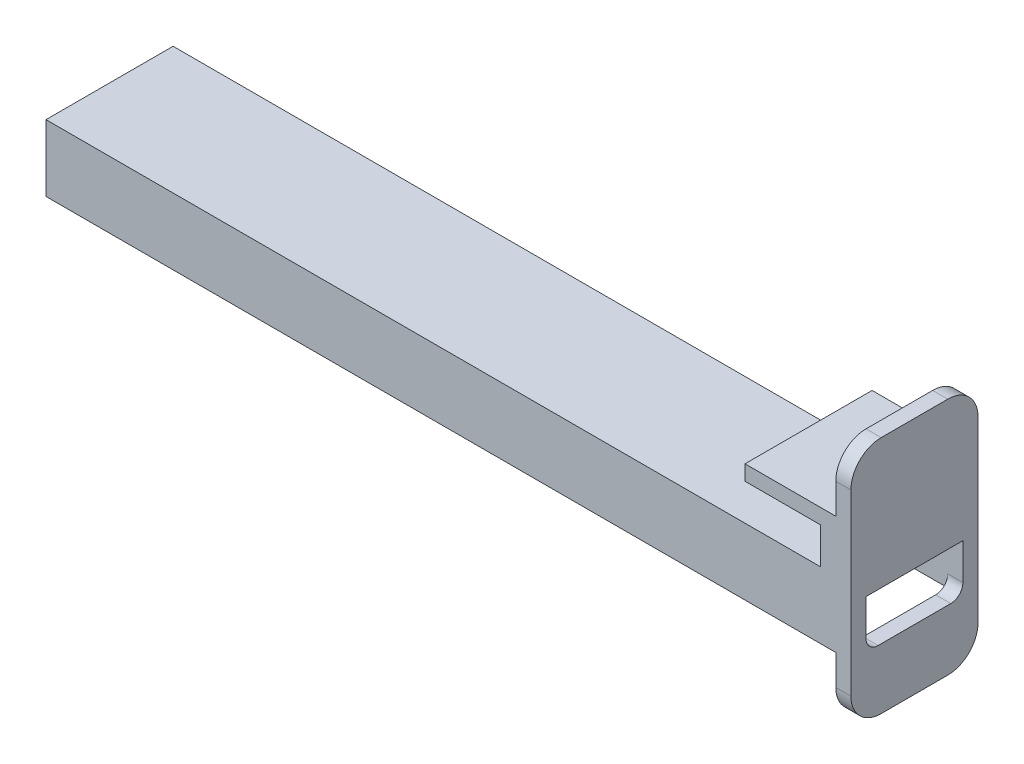
ISO-10303-21;
HEADER;
FILE_DESCRIPTION(('STEP AP214'),'2;1');
FILE_NAME('part.step','',(''),(''),'','','');
FILE_SCHEMA(('AUTOMOTIVE_DESIGN { 1 0 10303 214 1 1 1 1 }'));
ENDSEC;
DATA;
#1=APPLICATION_CONTEXT('core data for automotive mechanical design processes');
#2=APPLICATION_PROTOCOL_DEFINITION('international standard','automotive_design',2000,#1);
#3=PRODUCT_CONTEXT('',#1,'mechanical');
#4=PRODUCT('Part','Part','',(#3));
#5=PRODUCT_RELATED_PRODUCT_CATEGORY('part','',(#4));
#6=PRODUCT_DEFINITION_FORMATION('','',#4);
#7=PRODUCT_DEFINITION_CONTEXT('part definition',#1,'design');
#8=PRODUCT_DEFINITION('design','',#6,#7);
#9=PRODUCT_DEFINITION_SHAPE('','',#8);
#10=(LENGTH_UNIT() NAMED_UNIT(*) SI_UNIT(.MILLI.,.METRE.));
#11=(NAMED_UNIT(*) PLANE_ANGLE_UNIT() SI_UNIT($,.RADIAN.));
#12=(NAMED_UNIT(*) SI_UNIT($,.STERADIAN.) SOLID_ANGLE_UNIT());
#13=UNCERTAINTY_MEASURE_WITH_UNIT(LENGTH_MEASURE(1.E-05),#10,'distance_accuracy_value','');
#14=(GEOMETRIC_REPRESENTATION_CONTEXT(3) GLOBAL_UNCERTAINTY_ASSIGNED_CONTEXT((#13)) GLOBAL_UNIT_ASSIGNED_CONTEXT((#10,
#11,#12)) REPRESENTATION_CONTEXT('',''));
#15=CARTESIAN_POINT('',(0.,0.,0.));
#16=DIRECTION('',(0.,0.,1.));
#17=DIRECTION('',(1.,0.,0.));
#18=AXIS2_PLACEMENT_3D('',#15,#16,#17);
#19=CARTESIAN_POINT('',(0.,0.,0.));
#20=DIRECTION('',(0.,1.,0.));
#21=DIRECTION('',(0.,0.,1.));
#22=AXIS2_PLACEMENT_3D('',#19,#20,#21);
#23=PLANE('',#22);
#24=DIRECTION('',(0.,0.,-1.));
#25=VECTOR('',#24,1.);
#26=CARTESIAN_POINT('',(76.8846153846154,0.,5.53846153846154));
#27=LINE('',#26,#25);
#28=CARTESIAN_POINT('',(76.8846153846154,0.,-12.9615384615384));
#29=VERTEX_POINT('',#28);
#30=CARTESIAN_POINT('',(76.8846153846154,0.,-15.4615384615385));
#31=VERTEX_POINT('',#30);
#32=EDGE_CURVE('E217',#29,#31,#27,.T.);
#33=ORIENTED_EDGE('',*,*,#32,.F.);
#34=DIRECTION('',(1.,0.,0.));
#35=VECTOR('',#34,1.);
#36=CARTESIAN_POINT('',(0.,0.,-12.9615384615385));
#37=LINE('',#36,#35);
#38=CARTESIAN_POINT('',(-53.6153846153846,0.,-12.9615384615385));
#39=VERTEX_POINT('',#38);
#40=EDGE_CURVE('E261',#39,#29,#37,.T.);
#41=ORIENTED_EDGE('',*,*,#40,.F.);
#42=DIRECTION('',(0.,0.,1.));
#43=VECTOR('',#42,1.);
#44=CARTESIAN_POINT('',(-53.6153846153846,0.,0.));
#45=LINE('',#44,#43);
#46=CARTESIAN_POINT('',(-53.6153846153846,0.,-15.4615384615385));
#47=VERTEX_POINT('',#46);
#48=EDGE_CURVE('E253',#47,#39,#45,.T.);
#49=ORIENTED_EDGE('',*,*,#48,.F.);
#50=DIRECTION('',(1.,0.,0.));
#51=VECTOR('',#50,1.);
#52=CARTESIAN_POINT('',(0.,0.,-15.4615384615385));
#53=LINE('',#52,#51);
#54=EDGE_CURVE('E258',#47,#31,#53,.T.);
#55=ORIENTED_EDGE('',*,*,#54,.T.);
#56=EDGE_LOOP('',(#33,#41,#49,#55));
#57=FACE_BOUND('',#56,.T.);
#58=ADVANCED_FACE('F35',(#57),#23,.F.);
#59=CARTESIAN_POINT('',(-53.6153846153846,8.,0.));
#60=DIRECTION('',(1.,0.,0.));
#61=DIRECTION('',(0.,0.,-1.));
#62=AXIS2_PLACEMENT_3D('',#59,#60,#61);
#63=PLANE('',#62);
#64=ORIENTED_EDGE('',*,*,#48,.T.);
#65=DIRECTION('',(0.,-1.,0.));
#66=VECTOR('',#65,1.);
#67=CARTESIAN_POINT('',(-53.6153846153846,8.,-12.9615384615385));
#68=LINE('',#67,#66);
#69=CARTESIAN_POINT('',(-53.6153846153846,8.,-12.9615384615385));
#70=VERTEX_POINT('',#69);
#71=EDGE_CURVE('E266',#70,#39,#68,.T.);
#72=ORIENTED_EDGE('',*,*,#71,.F.);
#73=DIRECTION('',(0.,0.,1.));
#74=VECTOR('',#73,1.);
#75=CARTESIAN_POINT('',(-53.6153846153846,8.,-15.4615384615385));
#76=LINE('',#75,#74);
#77=CARTESIAN_POINT('',(-53.6153846153846,8.,3.03846153846154));
#78=VERTEX_POINT('',#77);
#79=EDGE_CURVE('E238',#70,#78,#76,.T.);
#80=ORIENTED_EDGE('',*,*,#79,.T.);
#81=DIRECTION('',(0.,-1.,0.));
#82=VECTOR('',#81,1.);
#83=CARTESIAN_POINT('',(-53.6153846153846,8.,3.03846153846154));
#84=LINE('',#83,#82);
#85=CARTESIAN_POINT('',(-53.6153846153846,0.,3.03846153846154));
#86=VERTEX_POINT('',#85);
#87=EDGE_CURVE('E232',#78,#86,#84,.T.);
#88=ORIENTED_EDGE('',*,*,#87,.T.);
#89=DIRECTION('',(0.,0.,1.));
#90=VECTOR('',#89,1.);
#91=CARTESIAN_POINT('',(-53.6153846153846,0.,0.));
#92=LINE('',#91,#90);
#93=CARTESIAN_POINT('',(-53.6153846153846,0.,5.53846153846154));
#94=VERTEX_POINT('',#93);
#95=EDGE_CURVE('E210',#86,#94,#92,.T.);
#96=ORIENTED_EDGE('',*,*,#95,.T.);
#97=DIRECTION('',(0.,-1.,0.));
#98=VECTOR('',#97,1.);
#99=CARTESIAN_POINT('',(-53.6153846153846,11.,5.53846153846154));
#100=LINE('',#99,#98);
#101=CARTESIAN_POINT('',(-53.6153846153846,11.,5.53846153846154));
#102=VERTEX_POINT('',#101);
#103=EDGE_CURVE('E249',#102,#94,#100,.T.);
#104=ORIENTED_EDGE('',*,*,#103,.F.);
#105=DIRECTION('',(0.,0.,1.));
#106=VECTOR('',#105,1.);
#107=CARTESIAN_POINT('',(-53.6153846153846,11.,-15.4615384615385));
#108=LINE('',#107,#106);
#109=CARTESIAN_POINT('',(-53.6153846153846,11.,-15.4615384615385));
#110=VERTEX_POINT('',#109);
#111=EDGE_CURVE('E239',#110,#102,#108,.T.);
#112=ORIENTED_EDGE('',*,*,#111,.F.);
#113=DIRECTION('',(0.,-1.,0.));
#114=VECTOR('',#113,1.);
#115=CARTESIAN_POINT('',(-53.6153846153846,8.,-15.4615384615385));
#116=LINE('',#115,#114);
#117=EDGE_CURVE('E257',#110,#47,#116,.T.);
#118=ORIENTED_EDGE('',*,*,#117,.T.);
#119=EDGE_LOOP('',(#64,#72,#80,#88,#96,#104,#112,#118));
#120=FACE_BOUND('',#119,.T.);
#121=ADVANCED_FACE('F420',(#120),#63,.F.);
#122=CARTESIAN_POINT('',(0.,8.,-12.9615384615385));
#123=DIRECTION('',(0.,0.,-1.));
#124=DIRECTION('',(-1.,0.,0.));
#125=AXIS2_PLACEMENT_3D('',#122,#123,#124);
#126=PLANE('',#125);
#127=ORIENTED_EDGE('',*,*,#40,.T.);
#128=DIRECTION('',(0.,1.,0.));
#129=VECTOR('',#128,1.);
#130=CARTESIAN_POINT('',(76.8846153846154,0.,-12.9615384615385));
#131=LINE('',#130,#129);
#132=CARTESIAN_POINT('',(76.8846153846154,2.,-12.9615384615385));
#133=VERTEX_POINT('',#132);
#134=EDGE_CURVE('E50',#29,#133,#131,.T.);
#135=ORIENTED_EDGE('',*,*,#134,.T.);
#136=DIRECTION('',(-1.,0.,0.));
#137=VECTOR('',#136,1.);
#138=CARTESIAN_POINT('',(79.3846153846154,2.,-12.9615384615385));
#139=LINE('',#138,#137);
#140=CARTESIAN_POINT('',(79.3846153846154,2.,-12.9615384615385));
#141=VERTEX_POINT('',#140);
#142=EDGE_CURVE('E320',#133,#141,#139,.F.);
#143=ORIENTED_EDGE('',*,*,#142,.T.);
#144=DIRECTION('',(0.,1.,0.));
#145=VECTOR('',#144,1.);
#146=CARTESIAN_POINT('',(79.3846153846154,0.,-12.9615384615385));
#147=LINE('',#146,#145);
#148=CARTESIAN_POINT('',(79.3846153846154,8.,-12.9615384615385));
#149=VERTEX_POINT('',#148);
#150=EDGE_CURVE('E310',#141,#149,#147,.T.);
#151=ORIENTED_EDGE('',*,*,#150,.T.);
#152=DIRECTION('',(1.,0.,0.));
#153=VECTOR('',#152,1.);
#154=CARTESIAN_POINT('',(0.,8.,-12.9615384615385));
#155=LINE('',#154,#153);
#156=EDGE_CURVE('E254',#70,#149,#155,.T.);
#157=ORIENTED_EDGE('',*,*,#156,.F.);
#158=ORIENTED_EDGE('',*,*,#71,.T.);
#159=EDGE_LOOP('',(#127,#135,#143,#151,#157,#158));
#160=FACE_BOUND('',#159,.T.);
#161=ADVANCED_FACE('F351',(#160),#126,.F.);
#162=CARTESIAN_POINT('',(0.,8.,-15.4615384615385));
#163=DIRECTION('',(0.,0.,-1.));
#164=DIRECTION('',(-1.,0.,0.));
#165=AXIS2_PLACEMENT_3D('',#162,#163,#164);
#166=PLANE('',#165);
#167=DIRECTION('',(0.,1.,0.));
#168=VECTOR('',#167,1.);
#169=CARTESIAN_POINT('',(76.8846153846154,29.5,-15.4615384615385));
#170=LINE('',#169,#168);
#171=CARTESIAN_POINT('',(76.8846153846154,19.5,-15.4615384615385));
#172=VERTEX_POINT('',#171);
#173=CARTESIAN_POINT('',(76.8846153846154,24.5,-15.4615384615385));
#174=VERTEX_POINT('',#173);
#175=EDGE_CURVE('E366',#172,#174,#170,.T.);
#176=ORIENTED_EDGE('',*,*,#175,.T.);
#177=DIRECTION('',(-1.,0.,0.));
#178=VECTOR('',#177,1.);
#179=CARTESIAN_POINT('',(79.3846153846154,24.5,-15.4615384615385));
#180=LINE('',#179,#178);
#181=CARTESIAN_POINT('',(79.3846153846154,24.5,-15.4615384615385));
#182=VERTEX_POINT('',#181);
#183=EDGE_CURVE('E281',#174,#182,#180,.F.);
#184=ORIENTED_EDGE('',*,*,#183,.T.);
#185=DIRECTION('',(0.,1.,0.));
#186=VECTOR('',#185,1.);
#187=CARTESIAN_POINT('',(79.3846153846154,29.5,-15.4615384615385));
#188=LINE('',#187,#186);
#189=CARTESIAN_POINT('',(79.3846153846154,-5.,-15.4615384615385));
#190=VERTEX_POINT('',#189);
#191=EDGE_CURVE('E438',#190,#182,#188,.T.);
#192=ORIENTED_EDGE('',*,*,#191,.F.);
#193=DIRECTION('',(-1.,0.,0.));
#194=VECTOR('',#193,1.);
#195=CARTESIAN_POINT('',(76.8846153846154,-5.,-15.4615384615385));
#196=LINE('',#195,#194);
#197=CARTESIAN_POINT('',(76.8846153846154,-5.,-15.4615384615385));
#198=VERTEX_POINT('',#197);
#199=EDGE_CURVE('E278',#190,#198,#196,.T.);
#200=ORIENTED_EDGE('',*,*,#199,.T.);
#201=EDGE_CURVE('E359',#198,#31,#170,.T.);
#202=ORIENTED_EDGE('',*,*,#201,.T.);
#203=ORIENTED_EDGE('',*,*,#54,.F.);
#204=ORIENTED_EDGE('',*,*,#117,.F.);
#205=DIRECTION('',(-1.,0.,0.));
#206=VECTOR('',#205,1.);
#207=CARTESIAN_POINT('',(-53.6153846153846,11.,-15.4615384615385));
#208=LINE('',#207,#206);
#209=CARTESIAN_POINT('',(74.3846153846154,11.,-15.4615384615385));
#210=VERTEX_POINT('',#209);
#211=EDGE_CURVE('E246',#210,#110,#208,.T.);
#212=ORIENTED_EDGE('',*,*,#211,.F.);
#213=DIRECTION('',(0.,1.,0.));
#214=VECTOR('',#213,1.);
#215=CARTESIAN_POINT('',(74.3846153846154,0.,-15.4615384615385));
#216=LINE('',#215,#214);
#217=CARTESIAN_POINT('',(74.3846153846154,17.,-15.4615384615385));
#218=VERTEX_POINT('',#217);
#219=EDGE_CURVE('E227',#210,#218,#216,.T.);
#220=ORIENTED_EDGE('',*,*,#219,.T.);
#221=DIRECTION('',(-1.,0.,0.));
#222=VECTOR('',#221,1.);
#223=CARTESIAN_POINT('',(76.8846153846154,17.,-15.4615384615385));
#224=LINE('',#223,#222);
#225=CARTESIAN_POINT('',(61.8846153846154,17.,-15.4615384615385));
#226=VERTEX_POINT('',#225);
#227=EDGE_CURVE('E387',#218,#226,#224,.T.);
#228=ORIENTED_EDGE('',*,*,#227,.T.);
#229=DIRECTION('',(0.,-1.,0.));
#230=VECTOR('',#229,1.);
#231=CARTESIAN_POINT('',(61.8846153846154,19.5,-15.4615384615385));
#232=LINE('',#231,#230);
#233=CARTESIAN_POINT('',(61.8846153846154,19.5,-15.4615384615385));
#234=VERTEX_POINT('',#233);
#235=EDGE_CURVE('E222',#234,#226,#232,.T.);
#236=ORIENTED_EDGE('',*,*,#235,.F.);
#237=DIRECTION('',(-1.,0.,0.));
#238=VECTOR('',#237,1.);
#239=CARTESIAN_POINT('',(76.8846153846154,19.5,-15.4615384615385));
#240=LINE('',#239,#238);
#241=EDGE_CURVE('E378',#172,#234,#240,.T.);
#242=ORIENTED_EDGE('',*,*,#241,.F.);
#243=EDGE_LOOP('',(#176,#184,#192,#200,#202,#203,#204,#212,#220,#228,#236,#242));
#244=FACE_BOUND('',#243,.T.);
#245=ADVANCED_FACE('F362',(#244),#166,.T.);
#246=DIRECTION('',(1.,0.,0.));
#247=VECTOR('',#246,1.);
#248=CARTESIAN_POINT('',(0.,0.,3.03846153846154));
#249=LINE('',#248,#247);
#250=CARTESIAN_POINT('',(76.8846153846154,0.,3.03846153846154));
#251=VERTEX_POINT('',#250);
#252=EDGE_CURVE('E199',#86,#251,#249,.T.);
#253=ORIENTED_EDGE('',*,*,#252,.T.);
#254=CARTESIAN_POINT('',(76.8846153846154,0.,5.53846153846154));
#255=VERTEX_POINT('',#254);
#256=EDGE_CURVE('E208',#255,#251,#27,.T.);
#257=ORIENTED_EDGE('',*,*,#256,.F.);
#258=DIRECTION('',(1.,0.,0.));
#259=VECTOR('',#258,1.);
#260=CARTESIAN_POINT('',(0.,0.,5.53846153846154));
#261=LINE('',#260,#259);
#262=EDGE_CURVE('E233',#94,#255,#261,.T.);
#263=ORIENTED_EDGE('',*,*,#262,.F.);
#264=ORIENTED_EDGE('',*,*,#95,.F.);
#265=EDGE_LOOP('',(#253,#257,#263,#264));
#266=FACE_BOUND('',#265,.T.);
#267=ADVANCED_FACE('F206',(#266),#23,.F.);
#268=CARTESIAN_POINT('',(0.,8.,0.));
#269=DIRECTION('',(0.,1.,0.));
#270=DIRECTION('',(0.,0.,1.));
#271=AXIS2_PLACEMENT_3D('',#268,#269,#270);
#272=PLANE('',#271);
#273=ORIENTED_EDGE('',*,*,#156,.T.);
#274=DIRECTION('',(0.,0.,1.));
#275=VECTOR('',#274,1.);
#276=CARTESIAN_POINT('',(79.3846153846154,8.,0.));
#277=LINE('',#276,#275);
#278=CARTESIAN_POINT('',(79.3846153846154,8.,3.03846153846154));
#279=VERTEX_POINT('',#278);
#280=EDGE_CURVE('E307',#149,#279,#277,.T.);
#281=ORIENTED_EDGE('',*,*,#280,.T.);
#282=DIRECTION('',(1.,0.,0.));
#283=VECTOR('',#282,1.);
#284=CARTESIAN_POINT('',(0.,8.,3.03846153846154));
#285=LINE('',#284,#283);
#286=EDGE_CURVE('E231',#78,#279,#285,.T.);
#287=ORIENTED_EDGE('',*,*,#286,.F.);
#288=ORIENTED_EDGE('',*,*,#79,.F.);
#289=EDGE_LOOP('',(#273,#281,#287,#288));
#290=FACE_BOUND('',#289,.T.);
#291=ADVANCED_FACE('F344',(#290),#272,.F.);
#292=CARTESIAN_POINT('',(-53.6153846153846,11.,5.53846153846154));
#293=DIRECTION('',(0.,0.,-1.));
#294=DIRECTION('',(-1.,0.,0.));
#295=AXIS2_PLACEMENT_3D('',#292,#293,#294);
#296=PLANE('',#295);
#297=DIRECTION('',(0.,-1.,0.));
#298=VECTOR('',#297,1.);
#299=CARTESIAN_POINT('',(79.3846153846154,29.5,5.53846153846154));
#300=LINE('',#299,#298);
#301=CARTESIAN_POINT('',(79.3846153846154,24.5,5.53846153846154));
#302=VERTEX_POINT('',#301);
#303=CARTESIAN_POINT('',(79.3846153846154,-5.,5.53846153846154));
#304=VERTEX_POINT('',#303);
#305=EDGE_CURVE('E369',#302,#304,#300,.T.);
#306=ORIENTED_EDGE('',*,*,#305,.F.);
#307=DIRECTION('',(-1.,0.,0.));
#308=VECTOR('',#307,1.);
#309=CARTESIAN_POINT('',(-53.6153846153846,24.5,5.53846153846154));
#310=LINE('',#309,#308);
#311=CARTESIAN_POINT('',(76.8846153846154,24.5,5.53846153846154));
#312=VERTEX_POINT('',#311);
#313=EDGE_CURVE('E293',#302,#312,#310,.T.);
#314=ORIENTED_EDGE('',*,*,#313,.T.);
#315=DIRECTION('',(0.,-1.,0.));
#316=VECTOR('',#315,1.);
#317=CARTESIAN_POINT('',(76.8846153846154,29.5,5.53846153846154));
#318=LINE('',#317,#316);
#319=CARTESIAN_POINT('',(76.8846153846154,19.5,5.53846153846154));
#320=VERTEX_POINT('',#319);
#321=EDGE_CURVE('E424',#312,#320,#318,.T.);
#322=ORIENTED_EDGE('',*,*,#321,.T.);
#323=DIRECTION('',(1.,0.,0.));
#324=VECTOR('',#323,1.);
#325=CARTESIAN_POINT('',(76.8846153846154,19.5,5.53846153846154));
#326=LINE('',#325,#324);
#327=CARTESIAN_POINT('',(61.8846153846154,19.5,5.53846153846154));
#328=VERTEX_POINT('',#327);
#329=EDGE_CURVE('E383',#328,#320,#326,.T.);
#330=ORIENTED_EDGE('',*,*,#329,.F.);
#331=DIRECTION('',(0.,-1.,0.));
#332=VECTOR('',#331,1.);
#333=CARTESIAN_POINT('',(61.8846153846154,19.5,5.53846153846154));
#334=LINE('',#333,#332);
#335=CARTESIAN_POINT('',(61.8846153846154,17.,5.53846153846154));
#336=VERTEX_POINT('',#335);
#337=EDGE_CURVE('E386',#328,#336,#334,.T.);
#338=ORIENTED_EDGE('',*,*,#337,.T.);
#339=DIRECTION('',(1.,0.,0.));
#340=VECTOR('',#339,1.);
#341=CARTESIAN_POINT('',(76.8846153846154,17.,5.53846153846154));
#342=LINE('',#341,#340);
#343=CARTESIAN_POINT('',(74.3846153846154,17.,5.53846153846154));
#344=VERTEX_POINT('',#343);
#345=EDGE_CURVE('E379',#336,#344,#342,.T.);
#346=ORIENTED_EDGE('',*,*,#345,.T.);
#347=DIRECTION('',(0.,-1.,0.));
#348=VECTOR('',#347,1.);
#349=CARTESIAN_POINT('',(74.3846153846154,0.,5.53846153846154));
#350=LINE('',#349,#348);
#351=CARTESIAN_POINT('',(74.3846153846154,11.,5.53846153846154));
#352=VERTEX_POINT('',#351);
#353=EDGE_CURVE('E224',#344,#352,#350,.T.);
#354=ORIENTED_EDGE('',*,*,#353,.T.);
#355=DIRECTION('',(1.,0.,0.));
#356=VECTOR('',#355,1.);
#357=CARTESIAN_POINT('',(-53.6153846153846,11.,5.53846153846154));
#358=LINE('',#357,#356);
#359=EDGE_CURVE('E242',#102,#352,#358,.T.);
#360=ORIENTED_EDGE('',*,*,#359,.F.);
#361=ORIENTED_EDGE('',*,*,#103,.T.);
#362=ORIENTED_EDGE('',*,*,#262,.T.);
#363=CARTESIAN_POINT('',(76.8846153846154,-5.,5.53846153846154));
#364=VERTEX_POINT('',#363);
#365=EDGE_CURVE('E215',#255,#364,#318,.T.);
#366=ORIENTED_EDGE('',*,*,#365,.T.);
#367=DIRECTION('',(-1.,0.,0.));
#368=VECTOR('',#367,1.);
#369=CARTESIAN_POINT('',(-53.6153846153846,-5.,5.53846153846154));
#370=LINE('',#369,#368);
#371=EDGE_CURVE('E291',#364,#304,#370,.F.);
#372=ORIENTED_EDGE('',*,*,#371,.T.);
#373=EDGE_LOOP('',(#306,#314,#322,#330,#338,#346,#354,#360,#361,#362,#366,#372));
#374=FACE_BOUND('',#373,.T.);
#375=ADVANCED_FACE('F410',(#374),#296,.F.);
#376=CARTESIAN_POINT('',(0.,11.,0.));
#377=DIRECTION('',(0.,1.,0.));
#378=DIRECTION('',(0.,0.,1.));
#379=AXIS2_PLACEMENT_3D('',#376,#377,#378);
#380=PLANE('',#379);
#381=ORIENTED_EDGE('',*,*,#111,.T.);
#382=ORIENTED_EDGE('',*,*,#359,.T.);
#383=DIRECTION('',(0.,0.,-1.));
#384=VECTOR('',#383,1.);
#385=CARTESIAN_POINT('',(74.3846153846154,11.,-15.4615384615385));
#386=LINE('',#385,#384);
#387=EDGE_CURVE('E244',#352,#210,#386,.T.);
#388=ORIENTED_EDGE('',*,*,#387,.T.);
#389=ORIENTED_EDGE('',*,*,#211,.T.);
#390=EDGE_LOOP('',(#381,#382,#388,#389));
#391=FACE_BOUND('',#390,.T.);
#392=ADVANCED_FACE('F417',(#391),#380,.T.);
#393=CARTESIAN_POINT('',(0.,8.,3.03846153846154));
#394=DIRECTION('',(0.,0.,-1.));
#395=DIRECTION('',(-1.,0.,0.));
#396=AXIS2_PLACEMENT_3D('',#393,#394,#395);
#397=PLANE('',#396);
#398=DIRECTION('',(0.,-1.,0.));
#399=VECTOR('',#398,1.);
#400=CARTESIAN_POINT('',(79.3846153846154,0.,3.03846153846154));
#401=LINE('',#400,#399);
#402=CARTESIAN_POINT('',(79.3846153846154,2.,3.03846153846154));
#403=VERTEX_POINT('',#402);
#404=EDGE_CURVE('E305',#279,#403,#401,.T.);
#405=ORIENTED_EDGE('',*,*,#404,.T.);
#406=DIRECTION('',(-1.,0.,0.));
#407=VECTOR('',#406,1.);
#408=CARTESIAN_POINT('',(0.,2.,3.03846153846154));
#409=LINE('',#408,#407);
#410=CARTESIAN_POINT('',(76.8846153846154,2.,3.03846153846154));
#411=VERTEX_POINT('',#410);
#412=EDGE_CURVE('E200',#403,#411,#409,.T.);
#413=ORIENTED_EDGE('',*,*,#412,.T.);
#414=DIRECTION('',(0.,-1.,0.));
#415=VECTOR('',#414,1.);
#416=CARTESIAN_POINT('',(76.8846153846154,8.,3.03846153846154));
#417=LINE('',#416,#415);
#418=EDGE_CURVE('E195',#411,#251,#417,.T.);
#419=ORIENTED_EDGE('',*,*,#418,.T.);
#420=ORIENTED_EDGE('',*,*,#252,.F.);
#421=ORIENTED_EDGE('',*,*,#87,.F.);
#422=ORIENTED_EDGE('',*,*,#286,.T.);
#423=EDGE_LOOP('',(#405,#413,#419,#420,#421,#422));
#424=FACE_BOUND('',#423,.T.);
#425=ADVANCED_FACE('F198',(#424),#397,.T.);
#426=CARTESIAN_POINT('',(74.3846153846154,0.,0.));
#427=DIRECTION('',(-1.,0.,0.));
#428=DIRECTION('',(0.,0.,1.));
#429=AXIS2_PLACEMENT_3D('',#426,#427,#428);
#430=PLANE('',#429);
#431=ORIENTED_EDGE('',*,*,#387,.F.);
#432=ORIENTED_EDGE('',*,*,#353,.F.);
#433=DIRECTION('',(0.,0.,1.));
#434=VECTOR('',#433,1.);
#435=CARTESIAN_POINT('',(74.3846153846154,17.,5.53846153846154));
#436=LINE('',#435,#434);
#437=EDGE_CURVE('E219',#218,#344,#436,.T.);
#438=ORIENTED_EDGE('',*,*,#437,.F.);
#439=ORIENTED_EDGE('',*,*,#219,.F.);
#440=EDGE_LOOP('',(#431,#432,#438,#439));
#441=FACE_BOUND('',#440,.T.);
#442=ADVANCED_FACE('F413',(#441),#430,.T.);
#443=CARTESIAN_POINT('',(61.8846153846154,19.5,-15.4615384615385));
#444=DIRECTION('',(1.,0.,0.));
#445=DIRECTION('',(0.,0.,-1.));
#446=AXIS2_PLACEMENT_3D('',#443,#444,#445);
#447=PLANE('',#446);
#448=DIRECTION('',(0.,0.,1.));
#449=VECTOR('',#448,1.);
#450=CARTESIAN_POINT('',(61.8846153846154,17.,-15.4615384615385));
#451=LINE('',#450,#449);
#452=EDGE_CURVE('E389',#226,#336,#451,.T.);
#453=ORIENTED_EDGE('',*,*,#452,.T.);
#454=ORIENTED_EDGE('',*,*,#337,.F.);
#455=DIRECTION('',(0.,0.,1.));
#456=VECTOR('',#455,1.);
#457=CARTESIAN_POINT('',(61.8846153846154,19.5,-15.4615384615385));
#458=LINE('',#457,#456);
#459=EDGE_CURVE('E381',#234,#328,#458,.T.);
#460=ORIENTED_EDGE('',*,*,#459,.F.);
#461=ORIENTED_EDGE('',*,*,#235,.T.);
#462=EDGE_LOOP('',(#453,#454,#460,#461));
#463=FACE_BOUND('',#462,.T.);
#464=ADVANCED_FACE('F403',(#463),#447,.F.);
#465=CARTESIAN_POINT('',(0.,19.5,0.));
#466=DIRECTION('',(0.,-1.,0.));
#467=DIRECTION('',(0.,0.,-1.));
#468=AXIS2_PLACEMENT_3D('',#465,#466,#467);
#469=PLANE('',#468);
#470=DIRECTION('',(0.,0.,-1.));
#471=VECTOR('',#470,1.);
#472=CARTESIAN_POINT('',(76.8846153846154,19.5,-15.4615384615385));
#473=LINE('',#472,#471);
#474=EDGE_CURVE('E375',#320,#172,#473,.T.);
#475=ORIENTED_EDGE('',*,*,#474,.T.);
#476=ORIENTED_EDGE('',*,*,#241,.T.);
#477=ORIENTED_EDGE('',*,*,#459,.T.);
#478=ORIENTED_EDGE('',*,*,#329,.T.);
#479=EDGE_LOOP('',(#475,#476,#477,#478));
#480=FACE_BOUND('',#479,.T.);
#481=ADVANCED_FACE('F465',(#480),#469,.F.);
#482=CARTESIAN_POINT('',(0.,17.,0.));
#483=DIRECTION('',(0.,-1.,0.));
#484=DIRECTION('',(0.,0.,-1.));
#485=AXIS2_PLACEMENT_3D('',#482,#483,#484);
#486=PLANE('',#485);
#487=ORIENTED_EDGE('',*,*,#227,.F.);
#488=ORIENTED_EDGE('',*,*,#437,.T.);
#489=ORIENTED_EDGE('',*,*,#345,.F.);
#490=ORIENTED_EDGE('',*,*,#452,.F.);
#491=EDGE_LOOP('',(#487,#488,#489,#490));
#492=FACE_BOUND('',#491,.T.);
#493=ADVANCED_FACE('F407',(#492),#486,.T.);
#494=CARTESIAN_POINT('',(76.8846153846154,0.,0.));
#495=DIRECTION('',(1.,0.,0.));
#496=DIRECTION('',(0.,0.,-1.));
#497=AXIS2_PLACEMENT_3D('',#494,#495,#496);
#498=PLANE('',#497);
#499=DIRECTION('',(0.,0.,-1.));
#500=VECTOR('',#499,1.);
#501=CARTESIAN_POINT('',(76.8846153846154,-10.,5.53846153846154));
#502=LINE('',#501,#500);
#503=CARTESIAN_POINT('',(76.8846153846154,-10.,0.538461538461541));
#504=VERTEX_POINT('',#503);
#505=CARTESIAN_POINT('',(76.8846153846154,-10.,-10.4615384615385));
#506=VERTEX_POINT('',#505);
#507=EDGE_CURVE('E371',#504,#506,#502,.T.);
#508=ORIENTED_EDGE('',*,*,#507,.F.);
#509=CARTESIAN_POINT('',(76.8846153846154,-5.,0.538461538461541));
#510=DIRECTION('',(1.,0.,0.));
#511=DIRECTION('',(0.,0.,-1.));
#512=AXIS2_PLACEMENT_3D('',#509,#510,#511);
#513=CIRCLE('',#512,5.);
#514=EDGE_CURVE('E303',#504,#364,#513,.F.);
#515=ORIENTED_EDGE('',*,*,#514,.T.);
#516=ORIENTED_EDGE('',*,*,#365,.F.);
#517=ORIENTED_EDGE('',*,*,#256,.T.);
#518=ORIENTED_EDGE('',*,*,#418,.F.);
#519=CARTESIAN_POINT('',(76.8846153846154,2.,1.03846153846154));
#520=DIRECTION('',(1.,0.,0.));
#521=DIRECTION('',(0.,0.,-1.));
#522=AXIS2_PLACEMENT_3D('',#519,#520,#521);
#523=CIRCLE('',#522,2.);
#524=CARTESIAN_POINT('',(76.8846153846154,0.,1.03846153846154));
#525=VERTEX_POINT('',#524);
#526=EDGE_CURVE('E43',#411,#525,#523,.T.);
#527=ORIENTED_EDGE('',*,*,#526,.T.);
#528=DIRECTION('',(0.,0.,-1.));
#529=VECTOR('',#528,1.);
#530=CARTESIAN_POINT('',(76.8846153846154,0.,0.));
#531=LINE('',#530,#529);
#532=CARTESIAN_POINT('',(76.8846153846154,0.,-10.9615384615385));
#533=VERTEX_POINT('',#532);
#534=EDGE_CURVE('E329',#525,#533,#531,.T.);
#535=ORIENTED_EDGE('',*,*,#534,.T.);
#536=CARTESIAN_POINT('',(76.8846153846154,2.,-10.9615384615385));
#537=DIRECTION('',(1.,0.,0.));
#538=DIRECTION('',(0.,0.,-1.));
#539=AXIS2_PLACEMENT_3D('',#536,#537,#538);
#540=CIRCLE('',#539,2.);
#541=EDGE_CURVE('E324',#533,#133,#540,.T.);
#542=ORIENTED_EDGE('',*,*,#541,.T.);
#543=ORIENTED_EDGE('',*,*,#134,.F.);
#544=ORIENTED_EDGE('',*,*,#32,.T.);
#545=ORIENTED_EDGE('',*,*,#201,.F.);
#546=CARTESIAN_POINT('',(76.8846153846154,-5.,-10.4615384615385));
#547=DIRECTION('',(1.,0.,0.));
#548=DIRECTION('',(0.,0.,-1.));
#549=AXIS2_PLACEMENT_3D('',#546,#547,#548);
#550=CIRCLE('',#549,5.);
#551=EDGE_CURVE('E301',#198,#506,#550,.F.);
#552=ORIENTED_EDGE('',*,*,#551,.T.);
#553=EDGE_LOOP('',(#508,#515,#516,#517,#518,#527,#535,#542,#543,#544,#545,#552));
#554=FACE_BOUND('',#553,.T.);
#555=ADVANCED_FACE('F213',(#554),#498,.F.);
#556=CARTESIAN_POINT('',(79.3846153846154,-10.,5.53846153846154));
#557=DIRECTION('',(0.,1.,0.));
#558=DIRECTION('',(0.,0.,1.));
#559=AXIS2_PLACEMENT_3D('',#556,#557,#558);
#560=PLANE('',#559);
#561=DIRECTION('',(0.,0.,-1.));
#562=VECTOR('',#561,1.);
#563=CARTESIAN_POINT('',(79.3846153846154,-10.,5.53846153846154));
#564=LINE('',#563,#562);
#565=CARTESIAN_POINT('',(79.3846153846154,-10.,0.538461538461541));
#566=VERTEX_POINT('',#565);
#567=CARTESIAN_POINT('',(79.3846153846154,-10.,-10.4615384615385));
#568=VERTEX_POINT('',#567);
#569=EDGE_CURVE('E432',#566,#568,#564,.T.);
#570=ORIENTED_EDGE('',*,*,#569,.F.);
#571=DIRECTION('',(-1.,0.,0.));
#572=VECTOR('',#571,1.);
#573=CARTESIAN_POINT('',(79.3846153846154,-10.,0.538461538461541));
#574=LINE('',#573,#572);
#575=EDGE_CURVE('E298',#566,#504,#574,.T.);
#576=ORIENTED_EDGE('',*,*,#575,.T.);
#577=ORIENTED_EDGE('',*,*,#507,.T.);
#578=DIRECTION('',(-1.,0.,0.));
#579=VECTOR('',#578,1.);
#580=CARTESIAN_POINT('',(79.3846153846154,-10.,-10.4615384615385));
#581=LINE('',#580,#579);
#582=EDGE_CURVE('E296',#506,#568,#581,.F.);
#583=ORIENTED_EDGE('',*,*,#582,.T.);
#584=EDGE_LOOP('',(#570,#576,#577,#583));
#585=FACE_BOUND('',#584,.T.);
#586=ADVANCED_FACE('F435',(#585),#560,.F.);
#587=CARTESIAN_POINT('',(79.3846153846154,29.5,5.53846153846154));
#588=DIRECTION('',(0.,-1.,0.));
#589=DIRECTION('',(0.,0.,-1.));
#590=AXIS2_PLACEMENT_3D('',#587,#588,#589);
#591=PLANE('',#590);
#592=DIRECTION('',(0.,0.,1.));
#593=VECTOR('',#592,1.);
#594=CARTESIAN_POINT('',(79.3846153846154,29.5,5.53846153846154));
#595=LINE('',#594,#593);
#596=CARTESIAN_POINT('',(79.3846153846154,29.5,-10.4615384615385));
#597=VERTEX_POINT('',#596);
#598=CARTESIAN_POINT('',(79.3846153846154,29.5,0.538461538461542));
#599=VERTEX_POINT('',#598);
#600=EDGE_CURVE('E390',#597,#599,#595,.T.);
#601=ORIENTED_EDGE('',*,*,#600,.F.);
#602=DIRECTION('',(-1.,0.,0.));
#603=VECTOR('',#602,1.);
#604=CARTESIAN_POINT('',(76.8846153846154,29.5,-10.4615384615385));
#605=LINE('',#604,#603);
#606=CARTESIAN_POINT('',(76.8846153846154,29.5,-10.4615384615385));
#607=VERTEX_POINT('',#606);
#608=EDGE_CURVE('E271',#597,#607,#605,.T.);
#609=ORIENTED_EDGE('',*,*,#608,.T.);
#610=DIRECTION('',(0.,0.,1.));
#611=VECTOR('',#610,1.);
#612=CARTESIAN_POINT('',(76.8846153846154,29.5,5.53846153846154));
#613=LINE('',#612,#611);
#614=CARTESIAN_POINT('',(76.8846153846154,29.5,0.538461538461542));
#615=VERTEX_POINT('',#614);
#616=EDGE_CURVE('E365',#607,#615,#613,.T.);
#617=ORIENTED_EDGE('',*,*,#616,.T.);
#618=DIRECTION('',(-1.,0.,0.));
#619=VECTOR('',#618,1.);
#620=CARTESIAN_POINT('',(79.3846153846154,29.5,0.538461538461541));
#621=LINE('',#620,#619);
#622=EDGE_CURVE('E269',#615,#599,#621,.F.);
#623=ORIENTED_EDGE('',*,*,#622,.T.);
#624=EDGE_LOOP('',(#601,#609,#617,#623));
#625=FACE_BOUND('',#624,.T.);
#626=ADVANCED_FACE('F456',(#625),#591,.F.);
#627=CARTESIAN_POINT('',(79.3846153846154,0.,0.));
#628=DIRECTION('',(1.,0.,0.));
#629=DIRECTION('',(0.,0.,-1.));
#630=AXIS2_PLACEMENT_3D('',#627,#628,#629);
#631=PLANE('',#630);
#632=DIRECTION('',(0.,0.,-1.));
#633=VECTOR('',#632,1.);
#634=CARTESIAN_POINT('',(79.3846153846154,0.,0.));
#635=LINE('',#634,#633);
#636=CARTESIAN_POINT('',(79.3846153846154,0.,1.03846153846154));
#637=VERTEX_POINT('',#636);
#638=CARTESIAN_POINT('',(79.3846153846154,0.,-10.9615384615385));
#639=VERTEX_POINT('',#638);
#640=EDGE_CURVE('E312',#637,#639,#635,.T.);
#641=ORIENTED_EDGE('',*,*,#640,.F.);
#642=CARTESIAN_POINT('',(79.3846153846154,2.,1.03846153846154));
#643=DIRECTION('',(1.,0.,0.));
#644=DIRECTION('',(0.,0.,-1.));
#645=AXIS2_PLACEMENT_3D('',#642,#643,#644);
#646=CIRCLE('',#645,2.);
#647=EDGE_CURVE('E11',#637,#403,#646,.F.);
#648=ORIENTED_EDGE('',*,*,#647,.T.);
#649=ORIENTED_EDGE('',*,*,#404,.F.);
#650=ORIENTED_EDGE('',*,*,#280,.F.);
#651=ORIENTED_EDGE('',*,*,#150,.F.);
#652=CARTESIAN_POINT('',(79.3846153846154,2.,-10.9615384615385));
#653=DIRECTION('',(1.,0.,0.));
#654=DIRECTION('',(0.,0.,-1.));
#655=AXIS2_PLACEMENT_3D('',#652,#653,#654);
#656=CIRCLE('',#655,2.);
#657=EDGE_CURVE('E326',#141,#639,#656,.F.);
#658=ORIENTED_EDGE('',*,*,#657,.T.);
#659=EDGE_LOOP('',(#641,#648,#649,#650,#651,#658));
#660=FACE_BOUND('',#659,.T.);
#661=ORIENTED_EDGE('',*,*,#191,.T.);
#662=CARTESIAN_POINT('',(79.3846153846154,24.5,-10.4615384615385));
#663=DIRECTION('',(1.,0.,0.));
#664=DIRECTION('',(0.,0.,-1.));
#665=AXIS2_PLACEMENT_3D('',#662,#663,#664);
#666=CIRCLE('',#665,5.);
#667=EDGE_CURVE('E289',#182,#597,#666,.T.);
#668=ORIENTED_EDGE('',*,*,#667,.T.);
#669=ORIENTED_EDGE('',*,*,#600,.T.);
#670=CARTESIAN_POINT('',(79.3846153846154,24.5,0.538461538461541));
#671=DIRECTION('',(1.,0.,0.));
#672=DIRECTION('',(0.,0.,-1.));
#673=AXIS2_PLACEMENT_3D('',#670,#671,#672);
#674=CIRCLE('',#673,5.);
#675=EDGE_CURVE('E287',#599,#302,#674,.T.);
#676=ORIENTED_EDGE('',*,*,#675,.T.);
#677=ORIENTED_EDGE('',*,*,#305,.T.);
#678=CARTESIAN_POINT('',(79.3846153846154,-5.,0.538461538461541));
#679=DIRECTION('',(1.,0.,0.));
#680=DIRECTION('',(0.,0.,-1.));
#681=AXIS2_PLACEMENT_3D('',#678,#679,#680);
#682=CIRCLE('',#681,5.);
#683=EDGE_CURVE('E285',#304,#566,#682,.T.);
#684=ORIENTED_EDGE('',*,*,#683,.T.);
#685=ORIENTED_EDGE('',*,*,#569,.T.);
#686=CARTESIAN_POINT('',(79.3846153846154,-5.,-10.4615384615385));
#687=DIRECTION('',(1.,0.,0.));
#688=DIRECTION('',(0.,0.,-1.));
#689=AXIS2_PLACEMENT_3D('',#686,#687,#688);
#690=CIRCLE('',#689,5.);
#691=EDGE_CURVE('E283',#568,#190,#690,.T.);
#692=ORIENTED_EDGE('',*,*,#691,.T.);
#693=EDGE_LOOP('',(#661,#668,#669,#676,#677,#684,#685,#692));
#694=FACE_BOUND('',#693,.T.);
#695=ADVANCED_FACE('F338',(#660,#694),#631,.T.);
#696=ORIENTED_EDGE('',*,*,#616,.F.);
#697=CARTESIAN_POINT('',(76.8846153846154,24.5,-10.4615384615385));
#698=DIRECTION('',(1.,0.,0.));
#699=DIRECTION('',(0.,0.,-1.));
#700=AXIS2_PLACEMENT_3D('',#697,#698,#699);
#701=CIRCLE('',#700,5.);
#702=EDGE_CURVE('E276',#607,#174,#701,.F.);
#703=ORIENTED_EDGE('',*,*,#702,.T.);
#704=ORIENTED_EDGE('',*,*,#175,.F.);
#705=ORIENTED_EDGE('',*,*,#474,.F.);
#706=ORIENTED_EDGE('',*,*,#321,.F.);
#707=CARTESIAN_POINT('',(76.8846153846154,24.5,0.538461538461541));
#708=DIRECTION('',(1.,0.,0.));
#709=DIRECTION('',(0.,0.,-1.));
#710=AXIS2_PLACEMENT_3D('',#707,#708,#709);
#711=CIRCLE('',#710,5.);
#712=EDGE_CURVE('E274',#312,#615,#711,.F.);
#713=ORIENTED_EDGE('',*,*,#712,.T.);
#714=EDGE_LOOP('',(#696,#703,#704,#705,#706,#713));
#715=FACE_BOUND('',#714,.T.);
#716=ADVANCED_FACE('F463',(#715),#498,.F.);
#717=CARTESIAN_POINT('',(79.3846153846154,24.5,-10.4615384615385));
#718=DIRECTION('',(1.,0.,0.));
#719=DIRECTION('',(0.,0.,-1.));
#720=AXIS2_PLACEMENT_3D('',#717,#718,#719);
#721=CYLINDRICAL_SURFACE('',#720,5.);
#722=ORIENTED_EDGE('',*,*,#667,.F.);
#723=ORIENTED_EDGE('',*,*,#183,.F.);
#724=ORIENTED_EDGE('',*,*,#702,.F.);
#725=ORIENTED_EDGE('',*,*,#608,.F.);
#726=EDGE_LOOP('',(#722,#723,#724,#725));
#727=FACE_BOUND('',#726,.T.);
#728=ADVANCED_FACE('F451',(#727),#721,.T.);
#729=CARTESIAN_POINT('',(-53.6153846153846,24.5,0.538461538461541));
#730=DIRECTION('',(-1.,0.,0.));
#731=DIRECTION('',(0.,0.,1.));
#732=AXIS2_PLACEMENT_3D('',#729,#730,#731);
#733=CYLINDRICAL_SURFACE('',#732,5.);
#734=ORIENTED_EDGE('',*,*,#675,.F.);
#735=ORIENTED_EDGE('',*,*,#622,.F.);
#736=ORIENTED_EDGE('',*,*,#712,.F.);
#737=ORIENTED_EDGE('',*,*,#313,.F.);
#738=EDGE_LOOP('',(#734,#735,#736,#737));
#739=FACE_BOUND('',#738,.T.);
#740=ADVANCED_FACE('F460',(#739),#733,.T.);
#741=CARTESIAN_POINT('',(79.3846153846154,-5.,0.538461538461541));
#742=DIRECTION('',(-1.,0.,0.));
#743=DIRECTION('',(0.,0.,1.));
#744=AXIS2_PLACEMENT_3D('',#741,#742,#743);
#745=CYLINDRICAL_SURFACE('',#744,5.);
#746=ORIENTED_EDGE('',*,*,#683,.F.);
#747=ORIENTED_EDGE('',*,*,#371,.F.);
#748=ORIENTED_EDGE('',*,*,#514,.F.);
#749=ORIENTED_EDGE('',*,*,#575,.F.);
#750=EDGE_LOOP('',(#746,#747,#748,#749));
#751=FACE_BOUND('',#750,.T.);
#752=ADVANCED_FACE('F427',(#751),#745,.T.);
#753=CARTESIAN_POINT('',(0.,-5.,-10.4615384615385));
#754=DIRECTION('',(1.,0.,0.));
#755=DIRECTION('',(0.,0.,-1.));
#756=AXIS2_PLACEMENT_3D('',#753,#754,#755);
#757=CYLINDRICAL_SURFACE('',#756,5.);
#758=ORIENTED_EDGE('',*,*,#691,.F.);
#759=ORIENTED_EDGE('',*,*,#582,.F.);
#760=ORIENTED_EDGE('',*,*,#551,.F.);
#761=ORIENTED_EDGE('',*,*,#199,.F.);
#762=EDGE_LOOP('',(#758,#759,#760,#761));
#763=FACE_BOUND('',#762,.T.);
#764=ADVANCED_FACE('F447',(#763),#757,.T.);
#765=CARTESIAN_POINT('',(92.8846153846154,0.,-12.9615384615385));
#766=DIRECTION('',(0.,-1.,0.));
#767=DIRECTION('',(0.,0.,-1.));
#768=AXIS2_PLACEMENT_3D('',#765,#766,#767);
#769=PLANE('',#768);
#770=ORIENTED_EDGE('',*,*,#640,.T.);
#771=DIRECTION('',(-1.,0.,0.));
#772=VECTOR('',#771,1.);
#773=CARTESIAN_POINT('',(76.8846153846154,0.,-10.9615384615385));
#774=LINE('',#773,#772);
#775=EDGE_CURVE('E317',#639,#533,#774,.T.);
#776=ORIENTED_EDGE('',*,*,#775,.T.);
#777=ORIENTED_EDGE('',*,*,#534,.F.);
#778=DIRECTION('',(-1.,0.,0.));
#779=VECTOR('',#778,1.);
#780=CARTESIAN_POINT('',(92.8846153846154,0.,1.03846153846154));
#781=LINE('',#780,#779);
#782=EDGE_CURVE('E315',#525,#637,#781,.F.);
#783=ORIENTED_EDGE('',*,*,#782,.T.);
#784=EDGE_LOOP('',(#770,#776,#777,#783));
#785=FACE_BOUND('',#784,.T.);
#786=ADVANCED_FACE('F331',(#785),#769,.F.);
#787=CARTESIAN_POINT('',(92.8846153846154,2.,-10.9615384615385));
#788=DIRECTION('',(1.,0.,0.));
#789=DIRECTION('',(0.,0.,-1.));
#790=AXIS2_PLACEMENT_3D('',#787,#788,#789);
#791=CYLINDRICAL_SURFACE('',#790,2.);
#792=ORIENTED_EDGE('',*,*,#657,.F.);
#793=ORIENTED_EDGE('',*,*,#142,.F.);
#794=ORIENTED_EDGE('',*,*,#541,.F.);
#795=ORIENTED_EDGE('',*,*,#775,.F.);
#796=EDGE_LOOP('',(#792,#793,#794,#795));
#797=FACE_BOUND('',#796,.T.);
#798=ADVANCED_FACE('F350',(#797),#791,.F.);
#799=CARTESIAN_POINT('',(0.,2.,1.03846153846154));
#800=DIRECTION('',(-1.,0.,0.));
#801=DIRECTION('',(0.,0.,1.));
#802=AXIS2_PLACEMENT_3D('',#799,#800,#801);
#803=CYLINDRICAL_SURFACE('',#802,2.);
#804=ORIENTED_EDGE('',*,*,#647,.F.);
#805=ORIENTED_EDGE('',*,*,#782,.F.);
#806=ORIENTED_EDGE('',*,*,#526,.F.);
#807=ORIENTED_EDGE('',*,*,#412,.F.);
#808=EDGE_LOOP('',(#804,#805,#806,#807));
#809=FACE_BOUND('',#808,.T.);
#810=ADVANCED_FACE('F37',(#809),#803,.F.);
#811=CLOSED_SHELL('',(#58,#121,#161,#245,#267,#291,#375,#392,#425,#442,#464,#481,#493,#555,#586,
#626,#695,#716,#728,#740,#752,#764,#786,#798,#810));
#812=MANIFOLD_SOLID_BREP('B2',#811);
#813=ADVANCED_BREP_SHAPE_REPRESENTATION('',(#18,#812),#14);
#814=SHAPE_DEFINITION_REPRESENTATION(#9,#813);
ENDSEC;
END-ISO-10303-21;
